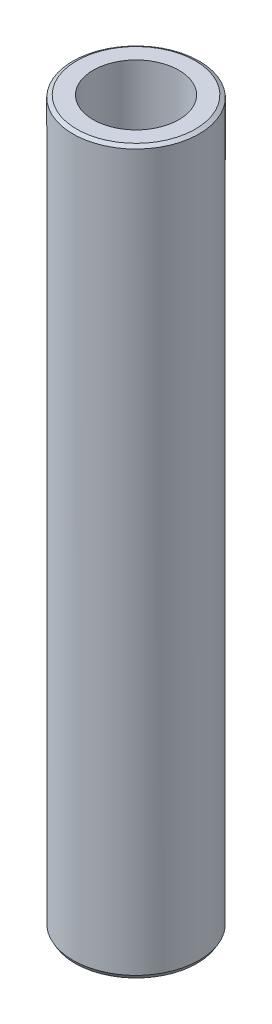
ISO-10303-21;
HEADER;
FILE_DESCRIPTION(('STEP AP214'),'2;1');
FILE_NAME('part.step','',(''),(''),'','','');
FILE_SCHEMA(('AUTOMOTIVE_DESIGN { 1 0 10303 214 1 1 1 1 }'));
ENDSEC;
DATA;
#1=APPLICATION_CONTEXT('core data for automotive mechanical design processes');
#2=APPLICATION_PROTOCOL_DEFINITION('international standard','automotive_design',2000,#1);
#3=PRODUCT_CONTEXT('',#1,'mechanical');
#4=PRODUCT('Part','Part','',(#3));
#5=PRODUCT_RELATED_PRODUCT_CATEGORY('part','',(#4));
#6=PRODUCT_DEFINITION_FORMATION('','',#4);
#7=PRODUCT_DEFINITION_CONTEXT('part definition',#1,'design');
#8=PRODUCT_DEFINITION('design','',#6,#7);
#9=PRODUCT_DEFINITION_SHAPE('','',#8);
#10=(LENGTH_UNIT() NAMED_UNIT(*) SI_UNIT(.MILLI.,.METRE.));
#11=(NAMED_UNIT(*) PLANE_ANGLE_UNIT() SI_UNIT($,.RADIAN.));
#12=(NAMED_UNIT(*) SI_UNIT($,.STERADIAN.) SOLID_ANGLE_UNIT());
#13=UNCERTAINTY_MEASURE_WITH_UNIT(LENGTH_MEASURE(1.E-05),#10,'distance_accuracy_value','');
#14=(GEOMETRIC_REPRESENTATION_CONTEXT(3) GLOBAL_UNCERTAINTY_ASSIGNED_CONTEXT((#13)) GLOBAL_UNIT_ASSIGNED_CONTEXT((#10,
#11,#12)) REPRESENTATION_CONTEXT('',''));
#15=CARTESIAN_POINT('',(0.,0.,0.));
#16=DIRECTION('',(0.,0.,1.));
#17=DIRECTION('',(1.,0.,0.));
#18=AXIS2_PLACEMENT_3D('',#15,#16,#17);
#19=CARTESIAN_POINT('',(0.,600.,0.));
#20=DIRECTION('',(0.,-1.,0.));
#21=DIRECTION('',(0.,0.,-1.));
#22=AXIS2_PLACEMENT_3D('',#19,#20,#21);
#23=CYLINDRICAL_SURFACE('',#22,52.5);
#24=CARTESIAN_POINT('',(0.,598.15026227043,0.));
#25=DIRECTION('',(0.,1.,0.));
#26=DIRECTION('',(0.,0.,1.));
#27=AXIS2_PLACEMENT_3D('',#24,#25,#26);
#28=CIRCLE('',#27,52.5);
#29=CARTESIAN_POINT('',(0.,598.15026227043,-52.5000000000001));
#30=VERTEX_POINT('',#29);
#31=EDGE_CURVE('E50',#30,#30,#28,.F.);
#32=ORIENTED_EDGE('',*,*,#31,.T.);
#33=EDGE_LOOP('',(#32));
#34=FACE_BOUND('',#33,.T.);
#35=CARTESIAN_POINT('',(0.,3.20383972829286,0.));
#36=DIRECTION('',(0.,1.,0.));
#37=DIRECTION('',(0.,0.,1.));
#38=AXIS2_PLACEMENT_3D('',#35,#36,#37);
#39=CIRCLE('',#38,52.5);
#40=CARTESIAN_POINT('',(0.,3.20383972829286,52.5));
#41=VERTEX_POINT('',#40);
#42=EDGE_CURVE('E51',#41,#41,#39,.T.);
#43=ORIENTED_EDGE('',*,*,#42,.T.);
#44=EDGE_LOOP('',(#43));
#45=FACE_BOUND('',#44,.T.);
#46=ADVANCED_FACE('F39',(#34,#45),#23,.T.);
#47=CARTESIAN_POINT('',(0.,600.,0.));
#48=DIRECTION('',(0.,1.,0.));
#49=DIRECTION('',(0.,0.,1.));
#50=AXIS2_PLACEMENT_3D('',#47,#48,#49);
#51=PLANE('',#50);
#52=CARTESIAN_POINT('',(0.,600.,0.));
#53=DIRECTION('',(0.,1.,0.));
#54=DIRECTION('',(0.,0.,1.));
#55=AXIS2_PLACEMENT_3D('',#52,#53,#54);
#56=CIRCLE('',#55,49.2961602717071);
#57=CARTESIAN_POINT('',(0.,600.,-49.2961602717072));
#58=VERTEX_POINT('',#57);
#59=EDGE_CURVE('E54',#58,#58,#56,.T.);
#60=ORIENTED_EDGE('',*,*,#59,.T.);
#61=EDGE_LOOP('',(#60));
#62=FACE_BOUND('',#61,.T.);
#63=CARTESIAN_POINT('',(0.,600.,0.));
#64=DIRECTION('',(0.,1.,0.));
#65=DIRECTION('',(0.,0.,1.));
#66=AXIS2_PLACEMENT_3D('',#63,#64,#65);
#67=CIRCLE('',#66,35.6475798471923);
#68=CARTESIAN_POINT('',(0.,600.,35.6475798471923));
#69=VERTEX_POINT('',#68);
#70=EDGE_CURVE('E58',#69,#69,#67,.T.);
#71=ORIENTED_EDGE('',*,*,#70,.F.);
#72=EDGE_LOOP('',(#71));
#73=FACE_BOUND('',#72,.T.);
#74=ADVANCED_FACE('F69',(#62,#73),#51,.T.);
#75=CARTESIAN_POINT('',(0.,0.,0.));
#76=DIRECTION('',(0.,1.,0.));
#77=DIRECTION('',(0.,0.,1.));
#78=AXIS2_PLACEMENT_3D('',#75,#76,#77);
#79=PLANE('',#78);
#80=CARTESIAN_POINT('',(0.,0.,0.));
#81=DIRECTION('',(0.,1.,0.));
#82=DIRECTION('',(0.,0.,1.));
#83=AXIS2_PLACEMENT_3D('',#80,#81,#82);
#84=CIRCLE('',#83,50.6502622704297);
#85=CARTESIAN_POINT('',(0.,0.,50.6502622704297));
#86=VERTEX_POINT('',#85);
#87=EDGE_CURVE('E10',#86,#86,#84,.F.);
#88=ORIENTED_EDGE('',*,*,#87,.T.);
#89=EDGE_LOOP('',(#88));
#90=FACE_BOUND('',#89,.T.);
#91=CARTESIAN_POINT('',(0.,0.,0.));
#92=DIRECTION('',(0.,1.,0.));
#93=DIRECTION('',(0.,0.,1.));
#94=AXIS2_PLACEMENT_3D('',#91,#92,#93);
#95=CIRCLE('',#94,35.6475798471923);
#96=CARTESIAN_POINT('',(0.,0.,35.6475798471923));
#97=VERTEX_POINT('',#96);
#98=EDGE_CURVE('E63',#97,#97,#95,.T.);
#99=ORIENTED_EDGE('',*,*,#98,.T.);
#100=EDGE_LOOP('',(#99));
#101=FACE_BOUND('',#100,.T.);
#102=ADVANCED_FACE('F75',(#90,#101),#79,.F.);
#103=CARTESIAN_POINT('',(0.,600.,0.));
#104=DIRECTION('',(0.,-1.,0.));
#105=DIRECTION('',(0.,0.,-1.));
#106=AXIS2_PLACEMENT_3D('',#103,#104,#105);
#107=CYLINDRICAL_SURFACE('',#106,35.6475798471923);
#108=ORIENTED_EDGE('',*,*,#70,.T.);
#109=EDGE_LOOP('',(#108));
#110=FACE_BOUND('',#109,.T.);
#111=ORIENTED_EDGE('',*,*,#98,.F.);
#112=EDGE_LOOP('',(#111));
#113=FACE_BOUND('',#112,.T.);
#114=ADVANCED_FACE('F70',(#110,#113),#107,.F.);
#115=CARTESIAN_POINT('',(0.,600.,0.));
#116=DIRECTION('',(0.,-1.,0.));
#117=DIRECTION('',(0.,0.,-1.));
#118=AXIS2_PLACEMENT_3D('',#115,#116,#117);
#119=CONICAL_SURFACE('',#118,49.2961602717071,1.0471975511966);
#120=CARTESIAN_POINT('',(0.,598.15026227043,-52.5000000000001));
#121=CARTESIAN_POINT('',(0.,598.169530371779,-52.466626669497));
#122=CARTESIAN_POINT('',(0.,598.188798473129,-52.433253338994));
#123=CARTESIAN_POINT('',(0.,598.227334675828,-52.3665066779879));
#124=CARTESIAN_POINT('',(0.,598.246602777178,-52.3331333474849));
#125=CARTESIAN_POINT('',(0.,598.285138979878,-52.2663866864787));
#126=CARTESIAN_POINT('',(0.,598.304407081227,-52.2330133559757));
#127=CARTESIAN_POINT('',(0.,598.342943283927,-52.1662666949696));
#128=CARTESIAN_POINT('',(0.,598.362211385276,-52.1328933644665));
#129=CARTESIAN_POINT('',(0.,598.400747587976,-52.0661467034604));
#130=CARTESIAN_POINT('',(0.,598.420015689325,-52.0327733729574));
#131=CARTESIAN_POINT('',(0.,598.458551892025,-51.9660267119513));
#132=CARTESIAN_POINT('',(0.,598.477819993374,-51.9326533814482));
#133=CARTESIAN_POINT('',(0.,598.516356196074,-51.8659067204421));
#134=CARTESIAN_POINT('',(0.,598.535624297424,-51.8325333899391));
#135=CARTESIAN_POINT('',(0.,598.574160500123,-51.765786728933));
#136=CARTESIAN_POINT('',(0.,598.593428601473,-51.7324133984299));
#137=CARTESIAN_POINT('',(0.,598.631964804172,-51.6656667374238));
#138=CARTESIAN_POINT('',(0.,598.651232905522,-51.6322934069208));
#139=CARTESIAN_POINT('',(0.,598.689769108221,-51.5655467459147));
#140=CARTESIAN_POINT('',(0.,598.709037209571,-51.5321734154116));
#141=CARTESIAN_POINT('',(0.,598.74757341227,-51.4654267544055));
#142=CARTESIAN_POINT('',(0.,598.76684151362,-51.4320534239025));
#143=CARTESIAN_POINT('',(0.,598.805377716319,-51.3653067628964));
#144=CARTESIAN_POINT('',(0.,598.824645817669,-51.3319334323933));
#145=CARTESIAN_POINT('',(0.,598.863182020368,-51.2651867713872));
#146=CARTESIAN_POINT('',(0.,598.882450121718,-51.2318134408842));
#147=CARTESIAN_POINT('',(0.,598.920986324417,-51.1650667798781));
#148=CARTESIAN_POINT('',(0.,598.940254425767,-51.131693449375));
#149=CARTESIAN_POINT('',(0.,598.978790628466,-51.0649467883689));
#150=CARTESIAN_POINT('',(0.,598.998058729816,-51.0315734578659));
#151=CARTESIAN_POINT('',(0.,599.036594932515,-50.9648267968598));
#152=CARTESIAN_POINT('',(0.,599.055863033865,-50.9314534663567));
#153=CARTESIAN_POINT('',(0.,599.094399236565,-50.8647068053506));
#154=CARTESIAN_POINT('',(0.,599.113667337914,-50.8313334748475));
#155=CARTESIAN_POINT('',(0.,599.152203540614,-50.7645868138415));
#156=CARTESIAN_POINT('',(0.,599.171471641963,-50.7312134833384));
#157=CARTESIAN_POINT('',(0.,599.210007844663,-50.6644668223323));
#158=CARTESIAN_POINT('',(0.,599.229275946012,-50.6310934918293));
#159=CARTESIAN_POINT('',(0.,599.267812148712,-50.5643468308231));
#160=CARTESIAN_POINT('',(0.,599.287080250061,-50.5309735003201));
#161=CARTESIAN_POINT('',(0.,599.325616452761,-50.464226839314));
#162=CARTESIAN_POINT('',(0.,599.344884554111,-50.430853508811));
#163=CARTESIAN_POINT('',(0.,599.38342075681,-50.3641068478049));
#164=CARTESIAN_POINT('',(0.,599.40268885816,-50.3307335173018));
#165=CARTESIAN_POINT('',(0.,599.441225060859,-50.2639868562957));
#166=CARTESIAN_POINT('',(0.,599.460493162209,-50.2306135257926));
#167=CARTESIAN_POINT('',(0.,599.499029364908,-50.1638668647866));
#168=CARTESIAN_POINT('',(0.,599.518297466258,-50.1304935342835));
#169=CARTESIAN_POINT('',(0.,599.556833668957,-50.0637468732774));
#170=CARTESIAN_POINT('',(0.,599.576101770307,-50.0303735427743));
#171=CARTESIAN_POINT('',(0.,599.614637973006,-49.9636268817682));
#172=CARTESIAN_POINT('',(0.,599.633906074356,-49.9302535512652));
#173=CARTESIAN_POINT('',(0.,599.672442277055,-49.8635068902591));
#174=CARTESIAN_POINT('',(0.,599.691710378405,-49.830133559756));
#175=CARTESIAN_POINT('',(0.,599.730246581104,-49.7633868987499));
#176=CARTESIAN_POINT('',(0.,599.749514682454,-49.7300135682469));
#177=CARTESIAN_POINT('',(0.,599.788050885153,-49.6632669072408));
#178=CARTESIAN_POINT('',(0.,599.807318986503,-49.6298935767377));
#179=CARTESIAN_POINT('',(0.,599.845855189202,-49.5631469157316));
#180=CARTESIAN_POINT('',(0.,599.865123290552,-49.5297735852286));
#181=CARTESIAN_POINT('',(0.,599.903659493251,-49.4630269242225));
#182=CARTESIAN_POINT('',(0.,599.922927594601,-49.4296535937194));
#183=CARTESIAN_POINT('',(0.,599.961463797301,-49.3629069327133));
#184=CARTESIAN_POINT('',(0.,599.98073189865,-49.3295336022103));
#185=CARTESIAN_POINT('',(0.,600.,-49.2961602717072));
#186=B_SPLINE_CURVE_WITH_KNOTS('',3,(#120,#121,#122,#123,#124,#125,#126,#127,#128,#129,#130,
#131,#132,#133,#134,#135,#136,#137,#138,#139,#140,#141,#142,#143,#144,#145,#146,#147,#148,#149,
#150,#151,#152,#153,#154,#155,#156,#157,#158,#159,#160,#161,#162,#163,#164,#165,#166,#167,#168,
#169,#170,#171,#172,#173,#174,#175,#176,#177,#178,#179,#180,#181,#182,#183,#184,#185),
.UNSPECIFIED.,.F.,.F.,(4,2,2,2,2,2,2,2,2,2,2,2,2,2,2,2,2,2,2,2,2,2,2,2,2,2,2,2,2,2,2,2,4),(0.,
0.115608608098112,0.231217216196274,0.346825824294386,0.462434432392548,0.578043040490715,
0.693651648588821,0.809260256686989,0.924868864785151,1.04047747288326,1.15608608098142,
1.27169468907954,1.3873032971777,1.50291190527587,1.61852051337398,1.73412912147214,
1.84973772957031,1.96534633766841,2.08095494576658,2.19656355386469,2.31217216196286,
2.42778077006102,2.54338937815913,2.65899798625729,2.77460659435546,2.89021520245357,
3.00582381055173,3.12143241864984,3.23704102674801,3.35264963484618,3.46825824294428,
3.58386685104245,3.69947545914061),.UNSPECIFIED.);
#187=EDGE_CURVE('BSEAM81',#30,#58,#186,.T.);
#188=ORIENTED_EDGE('',*,*,#31,.F.);
#189=ORIENTED_EDGE('',*,*,#59,.F.);
#190=ORIENTED_EDGE('',*,*,#187,.T.);
#191=ORIENTED_EDGE('',*,*,#187,.F.);
#192=EDGE_LOOP('',(#188,#190,#189,#191));
#193=FACE_BOUND('',#192,.T.);
#194=ADVANCED_FACE('F81',(#193),#119,.T.);
#195=CARTESIAN_POINT('',(0.,3.20383972829286,0.));
#196=DIRECTION('',(0.,1.,0.));
#197=DIRECTION('',(0.,0.,1.));
#198=AXIS2_PLACEMENT_3D('',#195,#196,#197);
#199=CONICAL_SURFACE('',#198,52.5,0.52359877559829);
#200=ORIENTED_EDGE('',*,*,#87,.F.);
#201=EDGE_LOOP('',(#200));
#202=FACE_BOUND('',#201,.T.);
#203=ORIENTED_EDGE('',*,*,#42,.F.);
#204=EDGE_LOOP('',(#203));
#205=FACE_BOUND('',#204,.T.);
#206=ADVANCED_FACE('F45',(#202,#205),#199,.T.);
#207=CLOSED_SHELL('',(#46,#74,#102,#114,#194,#206));
#208=MANIFOLD_SOLID_BREP('B2',#207);
#209=ADVANCED_BREP_SHAPE_REPRESENTATION('',(#18,#208),#14);
#210=SHAPE_DEFINITION_REPRESENTATION(#9,#209);
ENDSEC;
END-ISO-10303-21;
